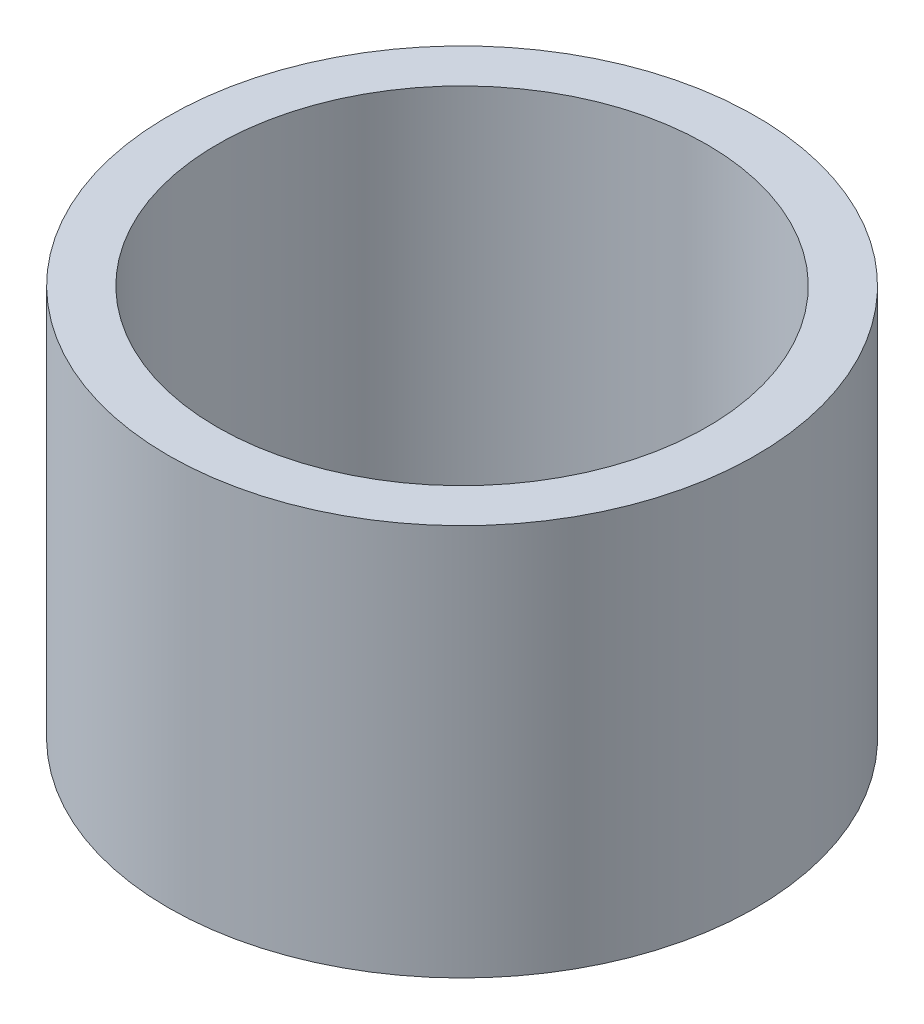
ISO-10303-21;
HEADER;
FILE_DESCRIPTION(('STEP AP214'),'2;1');
FILE_NAME('part.step','',(''),(''),'','','');
FILE_SCHEMA(('AUTOMOTIVE_DESIGN { 1 0 10303 214 1 1 1 1 }'));
ENDSEC;
DATA;
#1=APPLICATION_CONTEXT('core data for automotive mechanical design processes');
#2=APPLICATION_PROTOCOL_DEFINITION('international standard','automotive_design',2000,#1);
#3=PRODUCT_CONTEXT('',#1,'mechanical');
#4=PRODUCT('Part','Part','',(#3));
#5=PRODUCT_RELATED_PRODUCT_CATEGORY('part','',(#4));
#6=PRODUCT_DEFINITION_FORMATION('','',#4);
#7=PRODUCT_DEFINITION_CONTEXT('part definition',#1,'design');
#8=PRODUCT_DEFINITION('design','',#6,#7);
#9=PRODUCT_DEFINITION_SHAPE('','',#8);
#10=(LENGTH_UNIT() NAMED_UNIT(*) SI_UNIT(.MILLI.,.METRE.));
#11=(NAMED_UNIT(*) PLANE_ANGLE_UNIT() SI_UNIT($,.RADIAN.));
#12=(NAMED_UNIT(*) SI_UNIT($,.STERADIAN.) SOLID_ANGLE_UNIT());
#13=UNCERTAINTY_MEASURE_WITH_UNIT(LENGTH_MEASURE(1.E-05),#10,'distance_accuracy_value','');
#14=(GEOMETRIC_REPRESENTATION_CONTEXT(3) GLOBAL_UNCERTAINTY_ASSIGNED_CONTEXT((#13)) GLOBAL_UNIT_ASSIGNED_CONTEXT((#10,
#11,#12)) REPRESENTATION_CONTEXT('',''));
#15=CARTESIAN_POINT('',(0.,0.,0.));
#16=DIRECTION('',(0.,0.,1.));
#17=DIRECTION('',(1.,0.,0.));
#18=AXIS2_PLACEMENT_3D('',#15,#16,#17);
#19=CARTESIAN_POINT('',(0.,0.4,0.));
#20=DIRECTION('',(0.,1.,0.));
#21=DIRECTION('',(0.,0.,1.));
#22=AXIS2_PLACEMENT_3D('',#19,#20,#21);
#23=PLANE('',#22);
#24=CARTESIAN_POINT('',(0.,0.4,0.));
#25=DIRECTION('',(0.,1.,0.));
#26=DIRECTION('',(0.,0.,1.));
#27=AXIS2_PLACEMENT_3D('',#24,#25,#26);
#28=CIRCLE('',#27,0.3);
#29=CARTESIAN_POINT('',(0.,0.4,0.3));
#30=VERTEX_POINT('',#29);
#31=EDGE_CURVE('E10',#30,#30,#28,.T.);
#32=ORIENTED_EDGE('',*,*,#31,.T.);
#33=EDGE_LOOP('',(#32));
#34=FACE_BOUND('',#33,.T.);
#35=CARTESIAN_POINT('',(0.,0.4,0.));
#36=DIRECTION('',(0.,1.,0.));
#37=DIRECTION('',(0.,0.,1.));
#38=AXIS2_PLACEMENT_3D('',#35,#36,#37);
#39=CIRCLE('',#38,0.25);
#40=CARTESIAN_POINT('',(0.,0.4,0.25));
#41=VERTEX_POINT('',#40);
#42=EDGE_CURVE('E54',#41,#41,#39,.T.);
#43=ORIENTED_EDGE('',*,*,#42,.F.);
#44=EDGE_LOOP('',(#43));
#45=FACE_BOUND('',#44,.T.);
#46=ADVANCED_FACE('F41',(#34,#45),#23,.T.);
#47=CARTESIAN_POINT('',(0.,0.,0.));
#48=DIRECTION('',(0.,1.,0.));
#49=DIRECTION('',(0.,0.,1.));
#50=AXIS2_PLACEMENT_3D('',#47,#48,#49);
#51=PLANE('',#50);
#52=CARTESIAN_POINT('',(0.,0.,0.));
#53=DIRECTION('',(0.,1.,0.));
#54=DIRECTION('',(0.,0.,1.));
#55=AXIS2_PLACEMENT_3D('',#52,#53,#54);
#56=CIRCLE('',#55,0.3);
#57=CARTESIAN_POINT('',(0.,0.,0.3));
#58=VERTEX_POINT('',#57);
#59=EDGE_CURVE('E45',#58,#58,#56,.T.);
#60=ORIENTED_EDGE('',*,*,#59,.F.);
#61=EDGE_LOOP('',(#60));
#62=FACE_BOUND('',#61,.T.);
#63=CARTESIAN_POINT('',(0.,0.,0.));
#64=DIRECTION('',(0.,1.,0.));
#65=DIRECTION('',(0.,0.,1.));
#66=AXIS2_PLACEMENT_3D('',#63,#64,#65);
#67=CIRCLE('',#66,0.25);
#68=CARTESIAN_POINT('',(0.,0.,0.25));
#69=VERTEX_POINT('',#68);
#70=EDGE_CURVE('E56',#69,#69,#67,.T.);
#71=ORIENTED_EDGE('',*,*,#70,.T.);
#72=EDGE_LOOP('',(#71));
#73=FACE_BOUND('',#72,.T.);
#74=ADVANCED_FACE('F68',(#62,#73),#51,.F.);
#75=CARTESIAN_POINT('',(0.,0.4,0.));
#76=DIRECTION('',(0.,-1.,0.));
#77=DIRECTION('',(0.,0.,-1.));
#78=AXIS2_PLACEMENT_3D('',#75,#76,#77);
#79=CYLINDRICAL_SURFACE('',#78,0.3);
#80=ORIENTED_EDGE('',*,*,#31,.F.);
#81=EDGE_LOOP('',(#80));
#82=FACE_BOUND('',#81,.T.);
#83=ORIENTED_EDGE('',*,*,#59,.T.);
#84=EDGE_LOOP('',(#83));
#85=FACE_BOUND('',#84,.T.);
#86=ADVANCED_FACE('F43',(#82,#85),#79,.T.);
#87=CARTESIAN_POINT('',(0.,0.4,0.));
#88=DIRECTION('',(0.,-1.,0.));
#89=DIRECTION('',(0.,0.,-1.));
#90=AXIS2_PLACEMENT_3D('',#87,#88,#89);
#91=CYLINDRICAL_SURFACE('',#90,0.25);
#92=ORIENTED_EDGE('',*,*,#42,.T.);
#93=EDGE_LOOP('',(#92));
#94=FACE_BOUND('',#93,.T.);
#95=ORIENTED_EDGE('',*,*,#70,.F.);
#96=EDGE_LOOP('',(#95));
#97=FACE_BOUND('',#96,.T.);
#98=ADVANCED_FACE('F64',(#94,#97),#91,.F.);
#99=CLOSED_SHELL('',(#46,#74,#86,#98));
#100=MANIFOLD_SOLID_BREP('B2',#99);
#101=ADVANCED_BREP_SHAPE_REPRESENTATION('',(#18,#100),#14);
#102=SHAPE_DEFINITION_REPRESENTATION(#9,#101);
ENDSEC;
END-ISO-10303-21;
